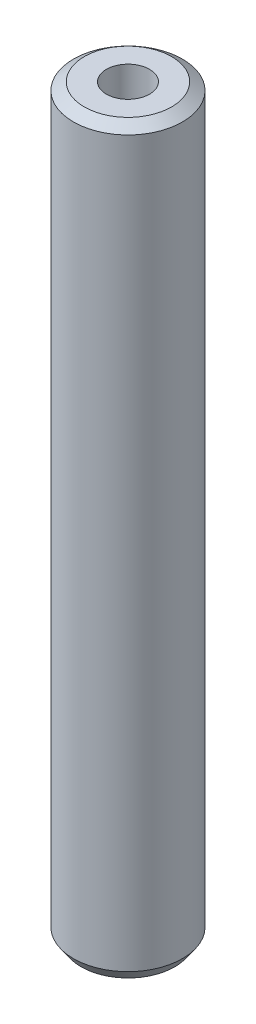
ISO-10303-21;
HEADER;
FILE_DESCRIPTION(('STEP AP214'),'2;1');
FILE_NAME('part.step','',(''),(''),'','','');
FILE_SCHEMA(('AUTOMOTIVE_DESIGN { 1 0 10303 214 1 1 1 1 }'));
ENDSEC;
DATA;
#1=APPLICATION_CONTEXT('core data for automotive mechanical design processes');
#2=APPLICATION_PROTOCOL_DEFINITION('international standard','automotive_design',2000,#1);
#3=PRODUCT_CONTEXT('',#1,'mechanical');
#4=PRODUCT('Part','Part','',(#3));
#5=PRODUCT_RELATED_PRODUCT_CATEGORY('part','',(#4));
#6=PRODUCT_DEFINITION_FORMATION('','',#4);
#7=PRODUCT_DEFINITION_CONTEXT('part definition',#1,'design');
#8=PRODUCT_DEFINITION('design','',#6,#7);
#9=PRODUCT_DEFINITION_SHAPE('','',#8);
#10=(LENGTH_UNIT() NAMED_UNIT(*) SI_UNIT(.MILLI.,.METRE.));
#11=(NAMED_UNIT(*) PLANE_ANGLE_UNIT() SI_UNIT($,.RADIAN.));
#12=(NAMED_UNIT(*) SI_UNIT($,.STERADIAN.) SOLID_ANGLE_UNIT());
#13=UNCERTAINTY_MEASURE_WITH_UNIT(LENGTH_MEASURE(1.E-05),#10,'distance_accuracy_value','');
#14=(GEOMETRIC_REPRESENTATION_CONTEXT(3) GLOBAL_UNCERTAINTY_ASSIGNED_CONTEXT((#13)) GLOBAL_UNIT_ASSIGNED_CONTEXT((#10,
#11,#12)) REPRESENTATION_CONTEXT('',''));
#15=CARTESIAN_POINT('',(0.,0.,0.));
#16=DIRECTION('',(0.,0.,1.));
#17=DIRECTION('',(1.,0.,0.));
#18=AXIS2_PLACEMENT_3D('',#15,#16,#17);
#19=CARTESIAN_POINT('',(0.,272.645993295994,0.));
#20=DIRECTION('',(0.,-1.,0.));
#21=DIRECTION('',(0.,0.,-1.));
#22=AXIS2_PLACEMENT_3D('',#19,#20,#21);
#23=CYLINDRICAL_SURFACE('',#22,20.);
#24=CARTESIAN_POINT('',(0.,269.864266006476,0.));
#25=DIRECTION('',(0.,1.,0.));
#26=DIRECTION('',(0.,0.,1.));
#27=AXIS2_PLACEMENT_3D('',#24,#25,#26);
#28=CIRCLE('',#27,20.);
#29=CARTESIAN_POINT('',(0.,269.864266006476,20.));
#30=VERTEX_POINT('',#29);
#31=EDGE_CURVE('E50',#30,#30,#28,.F.);
#32=ORIENTED_EDGE('',*,*,#31,.T.);
#33=EDGE_LOOP('',(#32));
#34=FACE_BOUND('',#33,.T.);
#35=CARTESIAN_POINT('',(0.,3.98251102964881,0.));
#36=DIRECTION('',(0.,1.,0.));
#37=DIRECTION('',(0.,0.,1.));
#38=AXIS2_PLACEMENT_3D('',#35,#36,#37);
#39=CIRCLE('',#38,20.);
#40=CARTESIAN_POINT('',(0.,3.98251102964881,20.));
#41=VERTEX_POINT('',#40);
#42=EDGE_CURVE('E51',#41,#41,#39,.T.);
#43=ORIENTED_EDGE('',*,*,#42,.T.);
#44=EDGE_LOOP('',(#43));
#45=FACE_BOUND('',#44,.T.);
#46=ADVANCED_FACE('F39',(#34,#45),#23,.T.);
#47=CARTESIAN_POINT('',(0.,272.645993295994,0.));
#48=DIRECTION('',(0.,1.,0.));
#49=DIRECTION('',(0.,0.,1.));
#50=AXIS2_PLACEMENT_3D('',#47,#48,#49);
#51=PLANE('',#50);
#52=CARTESIAN_POINT('',(0.,272.645993295994,0.));
#53=DIRECTION('',(0.,1.,0.));
#54=DIRECTION('',(0.,0.,1.));
#55=AXIS2_PLACEMENT_3D('',#52,#53,#54);
#56=CIRCLE('',#55,16.0174889703511);
#57=CARTESIAN_POINT('',(0.,272.645993295994,16.0174889703511));
#58=VERTEX_POINT('',#57);
#59=EDGE_CURVE('E54',#58,#58,#56,.T.);
#60=ORIENTED_EDGE('',*,*,#59,.T.);
#61=EDGE_LOOP('',(#60));
#62=FACE_BOUND('',#61,.T.);
#63=CARTESIAN_POINT('',(0.,272.645993295994,0.));
#64=DIRECTION('',(0.,1.,0.));
#65=DIRECTION('',(0.,0.,1.));
#66=AXIS2_PLACEMENT_3D('',#63,#64,#65);
#67=CIRCLE('',#66,7.91273764861999);
#68=CARTESIAN_POINT('',(0.,272.645993295994,7.91273764861999));
#69=VERTEX_POINT('',#68);
#70=EDGE_CURVE('E58',#69,#69,#67,.T.);
#71=ORIENTED_EDGE('',*,*,#70,.F.);
#72=EDGE_LOOP('',(#71));
#73=FACE_BOUND('',#72,.T.);
#74=ADVANCED_FACE('F69',(#62,#73),#51,.T.);
#75=CARTESIAN_POINT('',(0.,0.,0.));
#76=DIRECTION('',(0.,1.,0.));
#77=DIRECTION('',(0.,0.,1.));
#78=AXIS2_PLACEMENT_3D('',#75,#76,#77);
#79=PLANE('',#78);
#80=CARTESIAN_POINT('',(0.,0.,0.));
#81=DIRECTION('',(0.,1.,0.));
#82=DIRECTION('',(0.,0.,1.));
#83=AXIS2_PLACEMENT_3D('',#80,#81,#82);
#84=CIRCLE('',#83,17.2182727104824);
#85=CARTESIAN_POINT('',(0.,0.,17.2182727104824));
#86=VERTEX_POINT('',#85);
#87=EDGE_CURVE('E10',#86,#86,#84,.F.);
#88=ORIENTED_EDGE('',*,*,#87,.T.);
#89=EDGE_LOOP('',(#88));
#90=FACE_BOUND('',#89,.T.);
#91=CARTESIAN_POINT('',(0.,0.,0.));
#92=DIRECTION('',(0.,1.,0.));
#93=DIRECTION('',(0.,0.,1.));
#94=AXIS2_PLACEMENT_3D('',#91,#92,#93);
#95=CIRCLE('',#94,7.91273764861999);
#96=CARTESIAN_POINT('',(0.,0.,7.91273764861999));
#97=VERTEX_POINT('',#96);
#98=EDGE_CURVE('E63',#97,#97,#95,.T.);
#99=ORIENTED_EDGE('',*,*,#98,.T.);
#100=EDGE_LOOP('',(#99));
#101=FACE_BOUND('',#100,.T.);
#102=ADVANCED_FACE('F75',(#90,#101),#79,.F.);
#103=CARTESIAN_POINT('',(0.,272.645993295994,0.));
#104=DIRECTION('',(0.,-1.,0.));
#105=DIRECTION('',(0.,0.,-1.));
#106=AXIS2_PLACEMENT_3D('',#103,#104,#105);
#107=CYLINDRICAL_SURFACE('',#106,7.91273764861999);
#108=ORIENTED_EDGE('',*,*,#70,.T.);
#109=EDGE_LOOP('',(#108));
#110=FACE_BOUND('',#109,.T.);
#111=ORIENTED_EDGE('',*,*,#98,.F.);
#112=EDGE_LOOP('',(#111));
#113=FACE_BOUND('',#112,.T.);
#114=ADVANCED_FACE('F70',(#110,#113),#107,.F.);
#115=CARTESIAN_POINT('',(0.,272.645993295994,0.));
#116=DIRECTION('',(0.,-1.,0.));
#117=DIRECTION('',(0.,0.,-1.));
#118=AXIS2_PLACEMENT_3D('',#115,#116,#117);
#119=CONICAL_SURFACE('',#118,16.0174889703511,0.961087346179453);
#120=ORIENTED_EDGE('',*,*,#31,.F.);
#121=EDGE_LOOP('',(#120));
#122=FACE_BOUND('',#121,.T.);
#123=ORIENTED_EDGE('',*,*,#59,.F.);
#124=EDGE_LOOP('',(#123));
#125=FACE_BOUND('',#124,.T.);
#126=ADVANCED_FACE('F81',(#122,#125),#119,.T.);
#127=CARTESIAN_POINT('',(0.,3.98251102964881,0.));
#128=DIRECTION('',(0.,1.,0.));
#129=DIRECTION('',(0.,0.,1.));
#130=AXIS2_PLACEMENT_3D('',#127,#128,#129);
#131=CONICAL_SURFACE('',#130,20.,0.609708980615438);
#132=ORIENTED_EDGE('',*,*,#87,.F.);
#133=EDGE_LOOP('',(#132));
#134=FACE_BOUND('',#133,.T.);
#135=ORIENTED_EDGE('',*,*,#42,.F.);
#136=EDGE_LOOP('',(#135));
#137=FACE_BOUND('',#136,.T.);
#138=ADVANCED_FACE('F45',(#134,#137),#131,.T.);
#139=CLOSED_SHELL('',(#46,#74,#102,#114,#126,#138));
#140=MANIFOLD_SOLID_BREP('B2',#139);
#141=ADVANCED_BREP_SHAPE_REPRESENTATION('',(#18,#140),#14);
#142=SHAPE_DEFINITION_REPRESENTATION(#9,#141);
ENDSEC;
END-ISO-10303-21;
